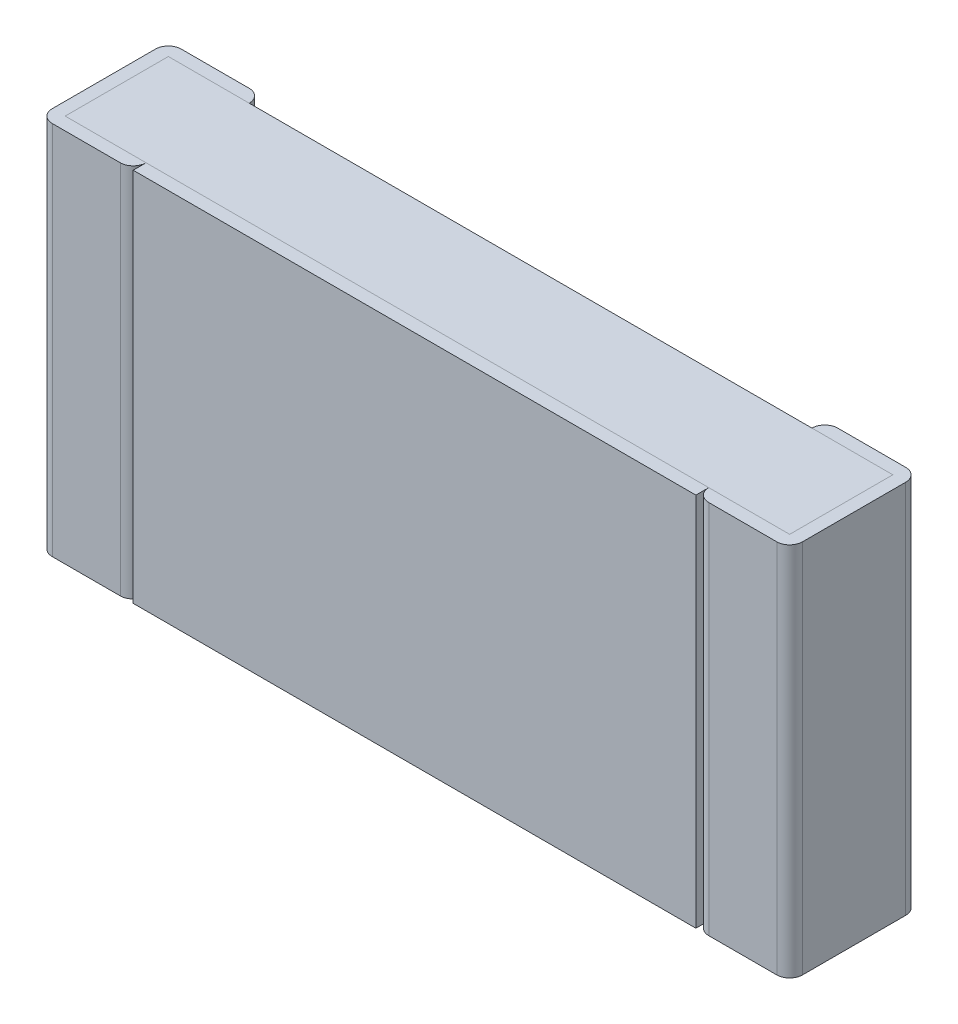
ISO-10303-21;
HEADER;
FILE_DESCRIPTION(('STEP AP214'),'2;1');
FILE_NAME('part.step','',(''),(''),'','','');
FILE_SCHEMA(('AUTOMOTIVE_DESIGN { 1 0 10303 214 1 1 1 1 }'));
ENDSEC;
DATA;
#1=APPLICATION_CONTEXT('core data for automotive mechanical design processes');
#2=APPLICATION_PROTOCOL_DEFINITION('international standard','automotive_design',2000,#1);
#3=PRODUCT_CONTEXT('',#1,'mechanical');
#4=PRODUCT('Part','Part','',(#3));
#5=PRODUCT_RELATED_PRODUCT_CATEGORY('part','',(#4));
#6=PRODUCT_DEFINITION_FORMATION('','',#4);
#7=PRODUCT_DEFINITION_CONTEXT('part definition',#1,'design');
#8=PRODUCT_DEFINITION('design','',#6,#7);
#9=PRODUCT_DEFINITION_SHAPE('','',#8);
#10=(LENGTH_UNIT() NAMED_UNIT(*) SI_UNIT(.MILLI.,.METRE.));
#11=(NAMED_UNIT(*) PLANE_ANGLE_UNIT() SI_UNIT($,.RADIAN.));
#12=(NAMED_UNIT(*) SI_UNIT($,.STERADIAN.) SOLID_ANGLE_UNIT());
#13=UNCERTAINTY_MEASURE_WITH_UNIT(LENGTH_MEASURE(1.E-05),#10,'distance_accuracy_value','');
#14=(GEOMETRIC_REPRESENTATION_CONTEXT(3) GLOBAL_UNCERTAINTY_ASSIGNED_CONTEXT((#13)) GLOBAL_UNIT_ASSIGNED_CONTEXT((#10,
#11,#12)) REPRESENTATION_CONTEXT('',''));
#15=CARTESIAN_POINT('',(0.,0.,0.));
#16=DIRECTION('',(0.,0.,1.));
#17=DIRECTION('',(1.,0.,0.));
#18=AXIS2_PLACEMENT_3D('',#15,#16,#17);
#19=CARTESIAN_POINT('',(-1.2,-0.8,0.55));
#20=DIRECTION('',(0.,0.,1.));
#21=DIRECTION('',(1.,0.,0.));
#22=AXIS2_PLACEMENT_3D('',#19,#20,#21);
#23=PLANE('',#22);
#24=DIRECTION('',(0.,1.,0.));
#25=VECTOR('',#24,1.);
#26=CARTESIAN_POINT('',(-1.2,-0.8,0.55));
#27=LINE('',#26,#25);
#28=CARTESIAN_POINT('',(-1.2,-0.8,0.55));
#29=VERTEX_POINT('',#28);
#30=CARTESIAN_POINT('',(-1.2,0.8,0.55));
#31=VERTEX_POINT('',#30);
#32=EDGE_CURVE('E305',#29,#31,#27,.T.);
#33=ORIENTED_EDGE('',*,*,#32,.F.);
#34=DIRECTION('',(1.,0.,0.));
#35=VECTOR('',#34,1.);
#36=CARTESIAN_POINT('',(-1.2,-0.8,0.55));
#37=LINE('',#36,#35);
#38=CARTESIAN_POINT('',(1.2,-0.8,0.55));
#39=VERTEX_POINT('',#38);
#40=EDGE_CURVE('E272',#29,#39,#37,.T.);
#41=ORIENTED_EDGE('',*,*,#40,.T.);
#42=DIRECTION('',(0.,1.,0.));
#43=VECTOR('',#42,1.);
#44=CARTESIAN_POINT('',(1.2,-0.8,0.55));
#45=LINE('',#44,#43);
#46=CARTESIAN_POINT('',(1.2,0.8,0.55));
#47=VERTEX_POINT('',#46);
#48=EDGE_CURVE('E11',#39,#47,#45,.T.);
#49=ORIENTED_EDGE('',*,*,#48,.T.);
#50=DIRECTION('',(1.,0.,0.));
#51=VECTOR('',#50,1.);
#52=CARTESIAN_POINT('',(-1.2,0.8,0.55));
#53=LINE('',#52,#51);
#54=EDGE_CURVE('E224',#31,#47,#53,.T.);
#55=ORIENTED_EDGE('',*,*,#54,.F.);
#56=EDGE_LOOP('',(#33,#41,#49,#55));
#57=FACE_BOUND('',#56,.T.);
#58=ADVANCED_FACE('F17',(#57),#23,.T.);
#59=CARTESIAN_POINT('',(1.2,-0.8,0.495));
#60=DIRECTION('',(1.,0.,0.));
#61=DIRECTION('',(0.,1.,0.));
#62=AXIS2_PLACEMENT_3D('',#59,#60,#61);
#63=PLANE('',#62);
#64=DIRECTION('',(0.,0.,1.));
#65=VECTOR('',#64,1.);
#66=CARTESIAN_POINT('',(1.2,-0.8,0.495));
#67=LINE('',#66,#65);
#68=CARTESIAN_POINT('',(1.2,-0.8,0.495));
#69=VERTEX_POINT('',#68);
#70=EDGE_CURVE('E276',#69,#39,#67,.T.);
#71=ORIENTED_EDGE('',*,*,#70,.F.);
#72=DIRECTION('',(0.,1.,0.));
#73=VECTOR('',#72,1.);
#74=CARTESIAN_POINT('',(1.2,-0.8,0.495));
#75=LINE('',#74,#73);
#76=CARTESIAN_POINT('',(1.2,0.8,0.495));
#77=VERTEX_POINT('',#76);
#78=EDGE_CURVE('E27',#69,#77,#75,.T.);
#79=ORIENTED_EDGE('',*,*,#78,.T.);
#80=DIRECTION('',(0.,0.,1.));
#81=VECTOR('',#80,1.);
#82=CARTESIAN_POINT('',(1.2,0.8,0.495));
#83=LINE('',#82,#81);
#84=EDGE_CURVE('E292',#77,#47,#83,.T.);
#85=ORIENTED_EDGE('',*,*,#84,.T.);
#86=ORIENTED_EDGE('',*,*,#48,.F.);
#87=EDGE_LOOP('',(#71,#79,#85,#86));
#88=FACE_BOUND('',#87,.T.);
#89=ADVANCED_FACE('F339',(#88),#63,.T.);
#90=CARTESIAN_POINT('',(1.255,-0.8,0.495));
#91=DIRECTION('',(0.,1.,0.));
#92=DIRECTION('',(-1.,0.,0.));
#93=AXIS2_PLACEMENT_3D('',#90,#91,#92);
#94=CYLINDRICAL_SURFACE('',#93,0.055);
#95=CARTESIAN_POINT('',(1.255,-0.8,0.495));
#96=DIRECTION('',(0.,1.,0.));
#97=DIRECTION('',(0.,0.,1.));
#98=AXIS2_PLACEMENT_3D('',#95,#96,#97);
#99=CIRCLE('',#98,0.055);
#100=CARTESIAN_POINT('',(1.255,-0.8,0.55));
#101=VERTEX_POINT('',#100);
#102=EDGE_CURVE('E309',#69,#101,#99,.T.);
#103=ORIENTED_EDGE('',*,*,#102,.T.);
#104=DIRECTION('',(0.,1.,0.));
#105=VECTOR('',#104,1.);
#106=CARTESIAN_POINT('',(1.255,-0.8,0.55));
#107=LINE('',#106,#105);
#108=CARTESIAN_POINT('',(1.255,0.8,0.55));
#109=VERTEX_POINT('',#108);
#110=EDGE_CURVE('E20',#101,#109,#107,.T.);
#111=ORIENTED_EDGE('',*,*,#110,.T.);
#112=CARTESIAN_POINT('',(1.255,0.8,0.495));
#113=DIRECTION('',(0.,1.,0.));
#114=DIRECTION('',(0.,0.,1.));
#115=AXIS2_PLACEMENT_3D('',#112,#113,#114);
#116=CIRCLE('',#115,0.055);
#117=EDGE_CURVE('E219',#77,#109,#116,.T.);
#118=ORIENTED_EDGE('',*,*,#117,.F.);
#119=ORIENTED_EDGE('',*,*,#78,.F.);
#120=EDGE_LOOP('',(#103,#111,#118,#119));
#121=FACE_BOUND('',#120,.T.);
#122=ADVANCED_FACE('F336',(#121),#94,.T.);
#123=CARTESIAN_POINT('',(1.2,-0.8,0.55));
#124=DIRECTION('',(0.,0.,1.));
#125=DIRECTION('',(1.,0.,0.));
#126=AXIS2_PLACEMENT_3D('',#123,#124,#125);
#127=PLANE('',#126);
#128=DIRECTION('',(1.,0.,0.));
#129=VECTOR('',#128,1.);
#130=CARTESIAN_POINT('',(1.2,0.8,0.55));
#131=LINE('',#130,#129);
#132=CARTESIAN_POINT('',(1.545,0.8,0.55));
#133=VERTEX_POINT('',#132);
#134=EDGE_CURVE('E213',#109,#133,#131,.T.);
#135=ORIENTED_EDGE('',*,*,#134,.F.);
#136=ORIENTED_EDGE('',*,*,#110,.F.);
#137=DIRECTION('',(1.,0.,0.));
#138=VECTOR('',#137,1.);
#139=CARTESIAN_POINT('',(1.2,-0.8,0.55));
#140=LINE('',#139,#138);
#141=CARTESIAN_POINT('',(1.545,-0.8,0.55));
#142=VERTEX_POINT('',#141);
#143=EDGE_CURVE('E313',#101,#142,#140,.T.);
#144=ORIENTED_EDGE('',*,*,#143,.T.);
#145=DIRECTION('',(0.,1.,0.));
#146=VECTOR('',#145,1.);
#147=CARTESIAN_POINT('',(1.545,-0.8,0.55));
#148=LINE('',#147,#146);
#149=EDGE_CURVE('E197',#142,#133,#148,.T.);
#150=ORIENTED_EDGE('',*,*,#149,.T.);
#151=EDGE_LOOP('',(#135,#136,#144,#150));
#152=FACE_BOUND('',#151,.T.);
#153=ADVANCED_FACE('F570',(#152),#127,.T.);
#154=CARTESIAN_POINT('',(1.545,-0.8,0.495));
#155=DIRECTION('',(0.,1.,0.));
#156=DIRECTION('',(1.,0.,0.));
#157=AXIS2_PLACEMENT_3D('',#154,#155,#156);
#158=CYLINDRICAL_SURFACE('',#157,0.055);
#159=DIRECTION('',(0.,1.,0.));
#160=VECTOR('',#159,1.);
#161=CARTESIAN_POINT('',(1.6,-0.8,0.495));
#162=LINE('',#161,#160);
#163=CARTESIAN_POINT('',(1.6,-0.8,0.495));
#164=VERTEX_POINT('',#163);
#165=CARTESIAN_POINT('',(1.6,0.8,0.495));
#166=VERTEX_POINT('',#165);
#167=EDGE_CURVE('E185',#164,#166,#162,.T.);
#168=ORIENTED_EDGE('',*,*,#167,.T.);
#169=CARTESIAN_POINT('',(1.545,0.8,0.495));
#170=DIRECTION('',(0.,-1.,0.));
#171=DIRECTION('',(0.,0.,1.));
#172=AXIS2_PLACEMENT_3D('',#169,#170,#171);
#173=CIRCLE('',#172,0.055);
#174=EDGE_CURVE('E189',#166,#133,#173,.T.);
#175=ORIENTED_EDGE('',*,*,#174,.T.);
#176=ORIENTED_EDGE('',*,*,#149,.F.);
#177=CARTESIAN_POINT('',(1.545,-0.8,0.495));
#178=DIRECTION('',(0.,-1.,0.));
#179=DIRECTION('',(0.,0.,1.));
#180=AXIS2_PLACEMENT_3D('',#177,#178,#179);
#181=CIRCLE('',#180,0.055);
#182=EDGE_CURVE('E192',#164,#142,#181,.T.);
#183=ORIENTED_EDGE('',*,*,#182,.F.);
#184=EDGE_LOOP('',(#168,#175,#176,#183));
#185=FACE_BOUND('',#184,.T.);
#186=ADVANCED_FACE('F187',(#185),#158,.T.);
#187=CARTESIAN_POINT('',(1.6,-0.8,0.));
#188=DIRECTION('',(1.,0.,0.));
#189=DIRECTION('',(0.,1.,0.));
#190=AXIS2_PLACEMENT_3D('',#187,#188,#189);
#191=PLANE('',#190);
#192=DIRECTION('',(0.,0.,1.));
#193=VECTOR('',#192,1.);
#194=CARTESIAN_POINT('',(1.6,-0.8,0.));
#195=LINE('',#194,#193);
#196=CARTESIAN_POINT('',(1.6,-0.8,0.055));
#197=VERTEX_POINT('',#196);
#198=EDGE_CURVE('E295',#197,#164,#195,.T.);
#199=ORIENTED_EDGE('',*,*,#198,.F.);
#200=DIRECTION('',(0.,1.,0.));
#201=VECTOR('',#200,1.);
#202=CARTESIAN_POINT('',(1.6,-0.8,0.055));
#203=LINE('',#202,#201);
#204=CARTESIAN_POINT('',(1.6,0.8,0.055));
#205=VERTEX_POINT('',#204);
#206=EDGE_CURVE('E198',#197,#205,#203,.T.);
#207=ORIENTED_EDGE('',*,*,#206,.T.);
#208=DIRECTION('',(0.,0.,1.));
#209=VECTOR('',#208,1.);
#210=CARTESIAN_POINT('',(1.6,0.8,0.));
#211=LINE('',#210,#209);
#212=EDGE_CURVE('E201',#205,#166,#211,.T.);
#213=ORIENTED_EDGE('',*,*,#212,.T.);
#214=ORIENTED_EDGE('',*,*,#167,.F.);
#215=EDGE_LOOP('',(#199,#207,#213,#214));
#216=FACE_BOUND('',#215,.T.);
#217=ADVANCED_FACE('F202',(#216),#191,.T.);
#218=CARTESIAN_POINT('',(1.545,-0.8,0.055));
#219=DIRECTION('',(0.,1.,0.));
#220=DIRECTION('',(1.,0.,0.));
#221=AXIS2_PLACEMENT_3D('',#218,#219,#220);
#222=CYLINDRICAL_SURFACE('',#221,0.055);
#223=CARTESIAN_POINT('',(1.545,-0.8,0.055));
#224=DIRECTION('',(0.,1.,0.));
#225=DIRECTION('',(0.,0.,1.));
#226=AXIS2_PLACEMENT_3D('',#223,#224,#225);
#227=CIRCLE('',#226,0.055);
#228=CARTESIAN_POINT('',(1.545,-0.8,0.));
#229=VERTEX_POINT('',#228);
#230=EDGE_CURVE('E298',#197,#229,#227,.T.);
#231=ORIENTED_EDGE('',*,*,#230,.T.);
#232=DIRECTION('',(0.,1.,0.));
#233=VECTOR('',#232,1.);
#234=CARTESIAN_POINT('',(1.545,-0.8,0.));
#235=LINE('',#234,#233);
#236=CARTESIAN_POINT('',(1.545,0.8,0.));
#237=VERTEX_POINT('',#236);
#238=EDGE_CURVE('E227',#229,#237,#235,.T.);
#239=ORIENTED_EDGE('',*,*,#238,.T.);
#240=CARTESIAN_POINT('',(1.545,0.8,0.055));
#241=DIRECTION('',(0.,1.,0.));
#242=DIRECTION('',(0.,0.,1.));
#243=AXIS2_PLACEMENT_3D('',#240,#241,#242);
#244=CIRCLE('',#243,0.055);
#245=EDGE_CURVE('E207',#205,#237,#244,.T.);
#246=ORIENTED_EDGE('',*,*,#245,.F.);
#247=ORIENTED_EDGE('',*,*,#206,.F.);
#248=EDGE_LOOP('',(#231,#239,#246,#247));
#249=FACE_BOUND('',#248,.T.);
#250=ADVANCED_FACE('F577',(#249),#222,.T.);
#251=CARTESIAN_POINT('',(1.2,-0.8,0.));
#252=DIRECTION('',(0.,0.,1.));
#253=DIRECTION('',(1.,0.,0.));
#254=AXIS2_PLACEMENT_3D('',#251,#252,#253);
#255=PLANE('',#254);
#256=ORIENTED_EDGE('',*,*,#238,.F.);
#257=DIRECTION('',(1.,0.,0.));
#258=VECTOR('',#257,1.);
#259=CARTESIAN_POINT('',(1.2,-0.8,0.));
#260=LINE('',#259,#258);
#261=CARTESIAN_POINT('',(1.255,-0.8,0.));
#262=VERTEX_POINT('',#261);
#263=EDGE_CURVE('E317',#262,#229,#260,.T.);
#264=ORIENTED_EDGE('',*,*,#263,.F.);
#265=DIRECTION('',(0.,1.,0.));
#266=VECTOR('',#265,1.);
#267=CARTESIAN_POINT('',(1.255,-0.8,0.));
#268=LINE('',#267,#266);
#269=CARTESIAN_POINT('',(1.255,0.8,0.));
#270=VERTEX_POINT('',#269);
#271=EDGE_CURVE('E229',#262,#270,#268,.T.);
#272=ORIENTED_EDGE('',*,*,#271,.T.);
#273=DIRECTION('',(1.,0.,0.));
#274=VECTOR('',#273,1.);
#275=CARTESIAN_POINT('',(1.2,0.8,0.));
#276=LINE('',#275,#274);
#277=EDGE_CURVE('E299',#270,#237,#276,.T.);
#278=ORIENTED_EDGE('',*,*,#277,.T.);
#279=EDGE_LOOP('',(#256,#264,#272,#278));
#280=FACE_BOUND('',#279,.T.);
#281=ADVANCED_FACE('F578',(#280),#255,.F.);
#282=CARTESIAN_POINT('',(1.255,-0.8,0.055));
#283=DIRECTION('',(0.,1.,0.));
#284=DIRECTION('',(-1.,0.,0.));
#285=AXIS2_PLACEMENT_3D('',#282,#283,#284);
#286=CYLINDRICAL_SURFACE('',#285,0.055);
#287=DIRECTION('',(0.,1.,0.));
#288=VECTOR('',#287,1.);
#289=CARTESIAN_POINT('',(1.2,-0.8,0.055));
#290=LINE('',#289,#288);
#291=CARTESIAN_POINT('',(1.2,-0.8,0.055));
#292=VERTEX_POINT('',#291);
#293=CARTESIAN_POINT('',(1.2,0.8,0.055));
#294=VERTEX_POINT('',#293);
#295=EDGE_CURVE('E291',#292,#294,#290,.T.);
#296=ORIENTED_EDGE('',*,*,#295,.T.);
#297=CARTESIAN_POINT('',(1.255,0.8,0.055));
#298=DIRECTION('',(0.,-1.,0.));
#299=DIRECTION('',(0.,0.,1.));
#300=AXIS2_PLACEMENT_3D('',#297,#298,#299);
#301=CIRCLE('',#300,0.055);
#302=EDGE_CURVE('E303',#294,#270,#301,.T.);
#303=ORIENTED_EDGE('',*,*,#302,.T.);
#304=ORIENTED_EDGE('',*,*,#271,.F.);
#305=CARTESIAN_POINT('',(1.255,-0.8,0.055));
#306=DIRECTION('',(0.,-1.,0.));
#307=DIRECTION('',(0.,0.,1.));
#308=AXIS2_PLACEMENT_3D('',#305,#306,#307);
#309=CIRCLE('',#308,0.055);
#310=EDGE_CURVE('E312',#292,#262,#309,.T.);
#311=ORIENTED_EDGE('',*,*,#310,.F.);
#312=EDGE_LOOP('',(#296,#303,#304,#311));
#313=FACE_BOUND('',#312,.T.);
#314=ADVANCED_FACE('F581',(#313),#286,.T.);
#315=CARTESIAN_POINT('',(-1.2,0.8,0.495));
#316=DIRECTION('',(0.,1.,0.));
#317=DIRECTION('',(1.,0.,0.));
#318=AXIS2_PLACEMENT_3D('',#315,#316,#317);
#319=PLANE('',#318);
#320=DIRECTION('',(1.,0.,0.));
#321=VECTOR('',#320,1.);
#322=CARTESIAN_POINT('',(-1.2,0.8,0.495));
#323=LINE('',#322,#321);
#324=CARTESIAN_POINT('',(-1.2,0.8,0.495));
#325=VERTEX_POINT('',#324);
#326=EDGE_CURVE('E267',#325,#77,#323,.T.);
#327=ORIENTED_EDGE('',*,*,#326,.F.);
#328=DIRECTION('',(0.,0.,1.));
#329=VECTOR('',#328,1.);
#330=CARTESIAN_POINT('',(-1.2,0.8,0.495));
#331=LINE('',#330,#329);
#332=EDGE_CURVE('E304',#325,#31,#331,.T.);
#333=ORIENTED_EDGE('',*,*,#332,.T.);
#334=ORIENTED_EDGE('',*,*,#54,.T.);
#335=ORIENTED_EDGE('',*,*,#84,.F.);
#336=EDGE_LOOP('',(#327,#333,#334,#335));
#337=FACE_BOUND('',#336,.T.);
#338=ADVANCED_FACE('F392',(#337),#319,.T.);
#339=CARTESIAN_POINT('',(1.2,0.8,0.));
#340=DIRECTION('',(0.,1.,0.));
#341=DIRECTION('',(1.,0.,0.));
#342=AXIS2_PLACEMENT_3D('',#339,#340,#341);
#343=PLANE('',#342);
#344=ORIENTED_EDGE('',*,*,#277,.F.);
#345=ORIENTED_EDGE('',*,*,#302,.F.);
#346=DIRECTION('',(1.,0.,0.));
#347=VECTOR('',#346,1.);
#348=CARTESIAN_POINT('',(-1.545,0.8,0.055));
#349=LINE('',#348,#347);
#350=CARTESIAN_POINT('',(1.545,0.8,0.055));
#351=VERTEX_POINT('',#350);
#352=EDGE_CURVE('E284',#294,#351,#349,.T.);
#353=ORIENTED_EDGE('',*,*,#352,.T.);
#354=DIRECTION('',(0.,0.,1.));
#355=VECTOR('',#354,1.);
#356=CARTESIAN_POINT('',(1.545,0.8,0.055));
#357=LINE('',#356,#355);
#358=CARTESIAN_POINT('',(1.545,0.8,0.495));
#359=VERTEX_POINT('',#358);
#360=EDGE_CURVE('E281',#351,#359,#357,.T.);
#361=ORIENTED_EDGE('',*,*,#360,.T.);
#362=DIRECTION('',(1.,0.,0.));
#363=VECTOR('',#362,1.);
#364=CARTESIAN_POINT('',(-1.545,0.8,0.495));
#365=LINE('',#364,#363);
#366=EDGE_CURVE('E280',#77,#359,#365,.T.);
#367=ORIENTED_EDGE('',*,*,#366,.F.);
#368=ORIENTED_EDGE('',*,*,#117,.T.);
#369=ORIENTED_EDGE('',*,*,#134,.T.);
#370=ORIENTED_EDGE('',*,*,#174,.F.);
#371=ORIENTED_EDGE('',*,*,#212,.F.);
#372=ORIENTED_EDGE('',*,*,#245,.T.);
#373=EDGE_LOOP('',(#344,#345,#353,#361,#367,#368,#369,#370,#371,#372));
#374=FACE_BOUND('',#373,.T.);
#375=ADVANCED_FACE('F210',(#374),#343,.T.);
#376=CARTESIAN_POINT('',(-1.2,-0.8,0.495));
#377=DIRECTION('',(1.,0.,0.));
#378=DIRECTION('',(0.,1.,0.));
#379=AXIS2_PLACEMENT_3D('',#376,#377,#378);
#380=PLANE('',#379);
#381=ORIENTED_EDGE('',*,*,#32,.T.);
#382=ORIENTED_EDGE('',*,*,#332,.F.);
#383=DIRECTION('',(0.,1.,0.));
#384=VECTOR('',#383,1.);
#385=CARTESIAN_POINT('',(-1.2,-0.8,0.495));
#386=LINE('',#385,#384);
#387=CARTESIAN_POINT('',(-1.2,-0.8,0.495));
#388=VERTEX_POINT('',#387);
#389=EDGE_CURVE('E263',#388,#325,#386,.T.);
#390=ORIENTED_EDGE('',*,*,#389,.F.);
#391=DIRECTION('',(0.,0.,1.));
#392=VECTOR('',#391,1.);
#393=CARTESIAN_POINT('',(-1.2,-0.8,0.495));
#394=LINE('',#393,#392);
#395=EDGE_CURVE('E275',#388,#29,#394,.T.);
#396=ORIENTED_EDGE('',*,*,#395,.T.);
#397=EDGE_LOOP('',(#381,#382,#390,#396));
#398=FACE_BOUND('',#397,.T.);
#399=ADVANCED_FACE('F394',(#398),#380,.F.);
#400=CARTESIAN_POINT('',(-1.2,-0.8,0.495));
#401=DIRECTION('',(0.,1.,0.));
#402=DIRECTION('',(1.,0.,0.));
#403=AXIS2_PLACEMENT_3D('',#400,#401,#402);
#404=PLANE('',#403);
#405=ORIENTED_EDGE('',*,*,#70,.T.);
#406=ORIENTED_EDGE('',*,*,#40,.F.);
#407=ORIENTED_EDGE('',*,*,#395,.F.);
#408=DIRECTION('',(1.,0.,0.));
#409=VECTOR('',#408,1.);
#410=CARTESIAN_POINT('',(-1.2,-0.8,0.495));
#411=LINE('',#410,#409);
#412=EDGE_CURVE('E262',#388,#69,#411,.T.);
#413=ORIENTED_EDGE('',*,*,#412,.T.);
#414=EDGE_LOOP('',(#405,#406,#407,#413));
#415=FACE_BOUND('',#414,.T.);
#416=ADVANCED_FACE('F349',(#415),#404,.F.);
#417=CARTESIAN_POINT('',(1.2,-0.8,0.));
#418=DIRECTION('',(0.,1.,0.));
#419=DIRECTION('',(1.,0.,0.));
#420=AXIS2_PLACEMENT_3D('',#417,#418,#419);
#421=PLANE('',#420);
#422=ORIENTED_EDGE('',*,*,#230,.F.);
#423=ORIENTED_EDGE('',*,*,#198,.T.);
#424=ORIENTED_EDGE('',*,*,#182,.T.);
#425=ORIENTED_EDGE('',*,*,#143,.F.);
#426=ORIENTED_EDGE('',*,*,#102,.F.);
#427=DIRECTION('',(1.,0.,0.));
#428=VECTOR('',#427,1.);
#429=CARTESIAN_POINT('',(-1.545,-0.8,0.495));
#430=LINE('',#429,#428);
#431=CARTESIAN_POINT('',(1.545,-0.8,0.495));
#432=VERTEX_POINT('',#431);
#433=EDGE_CURVE('E259',#69,#432,#430,.T.);
#434=ORIENTED_EDGE('',*,*,#433,.T.);
#435=DIRECTION('',(0.,0.,1.));
#436=VECTOR('',#435,1.);
#437=CARTESIAN_POINT('',(1.545,-0.8,0.055));
#438=LINE('',#437,#436);
#439=CARTESIAN_POINT('',(1.545,-0.8,0.055));
#440=VERTEX_POINT('',#439);
#441=EDGE_CURVE('E258',#440,#432,#438,.T.);
#442=ORIENTED_EDGE('',*,*,#441,.F.);
#443=DIRECTION('',(1.,0.,0.));
#444=VECTOR('',#443,1.);
#445=CARTESIAN_POINT('',(-1.545,-0.8,0.055));
#446=LINE('',#445,#444);
#447=EDGE_CURVE('E254',#292,#440,#446,.T.);
#448=ORIENTED_EDGE('',*,*,#447,.F.);
#449=ORIENTED_EDGE('',*,*,#310,.T.);
#450=ORIENTED_EDGE('',*,*,#263,.T.);
#451=EDGE_LOOP('',(#422,#423,#424,#425,#426,#434,#442,#448,#449,#450));
#452=FACE_BOUND('',#451,.T.);
#453=ADVANCED_FACE('F345',(#452),#421,.F.);
#454=CARTESIAN_POINT('',(-1.545,-0.8,0.055));
#455=DIRECTION('',(0.,0.,1.));
#456=DIRECTION('',(1.,0.,0.));
#457=AXIS2_PLACEMENT_3D('',#454,#455,#456);
#458=PLANE('',#457);
#459=DIRECTION('',(1.,0.,0.));
#460=VECTOR('',#459,1.);
#461=CARTESIAN_POINT('',(-1.545,0.8,0.055));
#462=LINE('',#461,#460);
#463=CARTESIAN_POINT('',(-1.2,0.8,0.055));
#464=VERTEX_POINT('',#463);
#465=EDGE_CURVE('E287',#464,#294,#462,.T.);
#466=ORIENTED_EDGE('',*,*,#465,.T.);
#467=ORIENTED_EDGE('',*,*,#295,.F.);
#468=DIRECTION('',(1.,0.,0.));
#469=VECTOR('',#468,1.);
#470=CARTESIAN_POINT('',(-1.545,-0.8,0.055));
#471=LINE('',#470,#469);
#472=CARTESIAN_POINT('',(-1.2,-0.8,0.055));
#473=VERTEX_POINT('',#472);
#474=EDGE_CURVE('E251',#473,#292,#471,.T.);
#475=ORIENTED_EDGE('',*,*,#474,.F.);
#476=DIRECTION('',(0.,1.,0.));
#477=VECTOR('',#476,1.);
#478=CARTESIAN_POINT('',(-1.2,-0.8,0.055));
#479=LINE('',#478,#477);
#480=EDGE_CURVE('E250',#473,#464,#479,.T.);
#481=ORIENTED_EDGE('',*,*,#480,.T.);
#482=EDGE_LOOP('',(#466,#467,#475,#481));
#483=FACE_BOUND('',#482,.T.);
#484=ADVANCED_FACE('F526',(#483),#458,.F.);
#485=CARTESIAN_POINT('',(-1.545,0.8,0.055));
#486=DIRECTION('',(0.,1.,0.));
#487=DIRECTION('',(1.,0.,0.));
#488=AXIS2_PLACEMENT_3D('',#485,#486,#487);
#489=PLANE('',#488);
#490=DIRECTION('',(1.,0.,0.));
#491=VECTOR('',#490,1.);
#492=CARTESIAN_POINT('',(-1.545,0.8,0.055));
#493=LINE('',#492,#491);
#494=CARTESIAN_POINT('',(-1.545,0.8,0.055));
#495=VERTEX_POINT('',#494);
#496=EDGE_CURVE('E364',#495,#464,#493,.T.);
#497=ORIENTED_EDGE('',*,*,#496,.F.);
#498=DIRECTION('',(0.,0.,1.));
#499=VECTOR('',#498,1.);
#500=CARTESIAN_POINT('',(-1.545,0.8,0.055));
#501=LINE('',#500,#499);
#502=CARTESIAN_POINT('',(-1.545,0.8,0.495));
#503=VERTEX_POINT('',#502);
#504=EDGE_CURVE('E367',#495,#503,#501,.T.);
#505=ORIENTED_EDGE('',*,*,#504,.T.);
#506=DIRECTION('',(1.,0.,0.));
#507=VECTOR('',#506,1.);
#508=CARTESIAN_POINT('',(-1.545,0.8,0.495));
#509=LINE('',#508,#507);
#510=EDGE_CURVE('E376',#503,#325,#509,.T.);
#511=ORIENTED_EDGE('',*,*,#510,.T.);
#512=ORIENTED_EDGE('',*,*,#326,.T.);
#513=ORIENTED_EDGE('',*,*,#366,.T.);
#514=ORIENTED_EDGE('',*,*,#360,.F.);
#515=ORIENTED_EDGE('',*,*,#352,.F.);
#516=ORIENTED_EDGE('',*,*,#465,.F.);
#517=EDGE_LOOP('',(#497,#505,#511,#512,#513,#514,#515,#516));
#518=FACE_BOUND('',#517,.T.);
#519=ADVANCED_FACE('F403',(#518),#489,.T.);
#520=CARTESIAN_POINT('',(-1.255,-0.8,0.495));
#521=DIRECTION('',(0.,1.,0.));
#522=DIRECTION('',(1.,0.,0.));
#523=AXIS2_PLACEMENT_3D('',#520,#521,#522);
#524=CYLINDRICAL_SURFACE('',#523,0.055);
#525=ORIENTED_EDGE('',*,*,#389,.T.);
#526=CARTESIAN_POINT('',(-1.255,0.8,0.495));
#527=DIRECTION('',(0.,-1.,0.));
#528=DIRECTION('',(0.,0.,1.));
#529=AXIS2_PLACEMENT_3D('',#526,#527,#528);
#530=CIRCLE('',#529,0.055);
#531=CARTESIAN_POINT('',(-1.255,0.8,0.55));
#532=VERTEX_POINT('',#531);
#533=EDGE_CURVE('E385',#325,#532,#530,.T.);
#534=ORIENTED_EDGE('',*,*,#533,.T.);
#535=DIRECTION('',(0.,1.,0.));
#536=VECTOR('',#535,1.);
#537=CARTESIAN_POINT('',(-1.255,-0.8,0.55));
#538=LINE('',#537,#536);
#539=CARTESIAN_POINT('',(-1.255,-0.8,0.55));
#540=VERTEX_POINT('',#539);
#541=EDGE_CURVE('E268',#540,#532,#538,.T.);
#542=ORIENTED_EDGE('',*,*,#541,.F.);
#543=CARTESIAN_POINT('',(-1.255,-0.8,0.495));
#544=DIRECTION('',(0.,-1.,0.));
#545=DIRECTION('',(0.,0.,1.));
#546=AXIS2_PLACEMENT_3D('',#543,#544,#545);
#547=CIRCLE('',#546,0.055);
#548=EDGE_CURVE('E401',#388,#540,#547,.T.);
#549=ORIENTED_EDGE('',*,*,#548,.F.);
#550=EDGE_LOOP('',(#525,#534,#542,#549));
#551=FACE_BOUND('',#550,.T.);
#552=ADVANCED_FACE('F397',(#551),#524,.T.);
#553=CARTESIAN_POINT('',(-1.6,-0.8,0.55));
#554=DIRECTION('',(0.,0.,1.));
#555=DIRECTION('',(1.,0.,0.));
#556=AXIS2_PLACEMENT_3D('',#553,#554,#555);
#557=PLANE('',#556);
#558=DIRECTION('',(1.,0.,0.));
#559=VECTOR('',#558,1.);
#560=CARTESIAN_POINT('',(-1.6,0.8,0.55));
#561=LINE('',#560,#559);
#562=CARTESIAN_POINT('',(-1.545,0.8,0.55));
#563=VERTEX_POINT('',#562);
#564=EDGE_CURVE('E406',#563,#532,#561,.T.);
#565=ORIENTED_EDGE('',*,*,#564,.F.);
#566=DIRECTION('',(0.,1.,0.));
#567=VECTOR('',#566,1.);
#568=CARTESIAN_POINT('',(-1.545,-0.8,0.55));
#569=LINE('',#568,#567);
#570=CARTESIAN_POINT('',(-1.545,-0.8,0.55));
#571=VERTEX_POINT('',#570);
#572=EDGE_CURVE('E419',#571,#563,#569,.T.);
#573=ORIENTED_EDGE('',*,*,#572,.F.);
#574=DIRECTION('',(1.,0.,0.));
#575=VECTOR('',#574,1.);
#576=CARTESIAN_POINT('',(-1.6,-0.8,0.55));
#577=LINE('',#576,#575);
#578=EDGE_CURVE('E431',#571,#540,#577,.T.);
#579=ORIENTED_EDGE('',*,*,#578,.T.);
#580=ORIENTED_EDGE('',*,*,#541,.T.);
#581=EDGE_LOOP('',(#565,#573,#579,#580));
#582=FACE_BOUND('',#581,.T.);
#583=ADVANCED_FACE('F553',(#582),#557,.T.);
#584=CARTESIAN_POINT('',(-1.545,-0.8,0.055));
#585=DIRECTION('',(0.,1.,0.));
#586=DIRECTION('',(1.,0.,0.));
#587=AXIS2_PLACEMENT_3D('',#584,#585,#586);
#588=PLANE('',#587);
#589=ORIENTED_EDGE('',*,*,#474,.T.);
#590=ORIENTED_EDGE('',*,*,#447,.T.);
#591=ORIENTED_EDGE('',*,*,#441,.T.);
#592=ORIENTED_EDGE('',*,*,#433,.F.);
#593=ORIENTED_EDGE('',*,*,#412,.F.);
#594=DIRECTION('',(1.,0.,0.));
#595=VECTOR('',#594,1.);
#596=CARTESIAN_POINT('',(-1.545,-0.8,0.495));
#597=LINE('',#596,#595);
#598=CARTESIAN_POINT('',(-1.545,-0.8,0.495));
#599=VERTEX_POINT('',#598);
#600=EDGE_CURVE('E445',#599,#388,#597,.T.);
#601=ORIENTED_EDGE('',*,*,#600,.F.);
#602=DIRECTION('',(0.,0.,1.));
#603=VECTOR('',#602,1.);
#604=CARTESIAN_POINT('',(-1.545,-0.8,0.055));
#605=LINE('',#604,#603);
#606=CARTESIAN_POINT('',(-1.545,-0.8,0.055));
#607=VERTEX_POINT('',#606);
#608=EDGE_CURVE('E448',#607,#599,#605,.T.);
#609=ORIENTED_EDGE('',*,*,#608,.F.);
#610=DIRECTION('',(1.,0.,0.));
#611=VECTOR('',#610,1.);
#612=CARTESIAN_POINT('',(-1.545,-0.8,0.055));
#613=LINE('',#612,#611);
#614=EDGE_CURVE('E456',#607,#473,#613,.T.);
#615=ORIENTED_EDGE('',*,*,#614,.T.);
#616=EDGE_LOOP('',(#589,#590,#591,#592,#593,#601,#609,#615));
#617=FACE_BOUND('',#616,.T.);
#618=ADVANCED_FACE('F356',(#617),#588,.F.);
#619=CARTESIAN_POINT('',(-1.255,-0.8,0.055));
#620=DIRECTION('',(0.,1.,0.));
#621=DIRECTION('',(1.,0.,0.));
#622=AXIS2_PLACEMENT_3D('',#619,#620,#621);
#623=CYLINDRICAL_SURFACE('',#622,0.055);
#624=CARTESIAN_POINT('',(-1.255,-0.8,0.055));
#625=DIRECTION('',(0.,1.,0.));
#626=DIRECTION('',(0.,0.,1.));
#627=AXIS2_PLACEMENT_3D('',#624,#625,#626);
#628=CIRCLE('',#627,0.055);
#629=CARTESIAN_POINT('',(-1.255,-0.8,0.));
#630=VERTEX_POINT('',#629);
#631=EDGE_CURVE('E460',#473,#630,#628,.T.);
#632=ORIENTED_EDGE('',*,*,#631,.T.);
#633=DIRECTION('',(0.,1.,0.));
#634=VECTOR('',#633,1.);
#635=CARTESIAN_POINT('',(-1.255,-0.8,0.));
#636=LINE('',#635,#634);
#637=CARTESIAN_POINT('',(-1.255,0.8,0.));
#638=VERTEX_POINT('',#637);
#639=EDGE_CURVE('E373',#630,#638,#636,.T.);
#640=ORIENTED_EDGE('',*,*,#639,.T.);
#641=CARTESIAN_POINT('',(-1.255,0.8,0.055));
#642=DIRECTION('',(0.,1.,0.));
#643=DIRECTION('',(0.,0.,1.));
#644=AXIS2_PLACEMENT_3D('',#641,#642,#643);
#645=CIRCLE('',#644,0.055);
#646=EDGE_CURVE('E366',#464,#638,#645,.T.);
#647=ORIENTED_EDGE('',*,*,#646,.F.);
#648=ORIENTED_EDGE('',*,*,#480,.F.);
#649=EDGE_LOOP('',(#632,#640,#647,#648));
#650=FACE_BOUND('',#649,.T.);
#651=ADVANCED_FACE('F530',(#650),#623,.T.);
#652=CARTESIAN_POINT('',(-1.6,-0.8,0.));
#653=DIRECTION('',(0.,0.,1.));
#654=DIRECTION('',(1.,0.,0.));
#655=AXIS2_PLACEMENT_3D('',#652,#653,#654);
#656=PLANE('',#655);
#657=ORIENTED_EDGE('',*,*,#639,.F.);
#658=DIRECTION('',(1.,0.,0.));
#659=VECTOR('',#658,1.);
#660=CARTESIAN_POINT('',(-1.6,-0.8,0.));
#661=LINE('',#660,#659);
#662=CARTESIAN_POINT('',(-1.545,-0.8,0.));
#663=VERTEX_POINT('',#662);
#664=EDGE_CURVE('E426',#663,#630,#661,.T.);
#665=ORIENTED_EDGE('',*,*,#664,.F.);
#666=DIRECTION('',(0.,1.,0.));
#667=VECTOR('',#666,1.);
#668=CARTESIAN_POINT('',(-1.545,-0.8,0.));
#669=LINE('',#668,#667);
#670=CARTESIAN_POINT('',(-1.545,0.8,0.));
#671=VERTEX_POINT('',#670);
#672=EDGE_CURVE('E421',#663,#671,#669,.T.);
#673=ORIENTED_EDGE('',*,*,#672,.T.);
#674=DIRECTION('',(1.,0.,0.));
#675=VECTOR('',#674,1.);
#676=CARTESIAN_POINT('',(-1.6,0.8,0.));
#677=LINE('',#676,#675);
#678=EDGE_CURVE('E411',#671,#638,#677,.T.);
#679=ORIENTED_EDGE('',*,*,#678,.T.);
#680=EDGE_LOOP('',(#657,#665,#673,#679));
#681=FACE_BOUND('',#680,.T.);
#682=ADVANCED_FACE('F537',(#681),#656,.F.);
#683=CARTESIAN_POINT('',(-1.6,0.8,0.));
#684=DIRECTION('',(0.,1.,0.));
#685=DIRECTION('',(1.,0.,0.));
#686=AXIS2_PLACEMENT_3D('',#683,#684,#685);
#687=PLANE('',#686);
#688=ORIENTED_EDGE('',*,*,#678,.F.);
#689=CARTESIAN_POINT('',(-1.545,0.8,0.055));
#690=DIRECTION('',(0.,-1.,0.));
#691=DIRECTION('',(0.,0.,1.));
#692=AXIS2_PLACEMENT_3D('',#689,#690,#691);
#693=CIRCLE('',#692,0.055);
#694=CARTESIAN_POINT('',(-1.6,0.8,0.055));
#695=VERTEX_POINT('',#694);
#696=EDGE_CURVE('E425',#695,#671,#693,.T.);
#697=ORIENTED_EDGE('',*,*,#696,.F.);
#698=DIRECTION('',(0.,0.,1.));
#699=VECTOR('',#698,1.);
#700=CARTESIAN_POINT('',(-1.6,0.8,0.));
#701=LINE('',#700,#699);
#702=CARTESIAN_POINT('',(-1.6,0.8,0.495));
#703=VERTEX_POINT('',#702);
#704=EDGE_CURVE('E477',#695,#703,#701,.T.);
#705=ORIENTED_EDGE('',*,*,#704,.T.);
#706=CARTESIAN_POINT('',(-1.545,0.8,0.495));
#707=DIRECTION('',(0.,1.,0.));
#708=DIRECTION('',(0.,0.,1.));
#709=AXIS2_PLACEMENT_3D('',#706,#707,#708);
#710=CIRCLE('',#709,0.055);
#711=EDGE_CURVE('E417',#703,#563,#710,.T.);
#712=ORIENTED_EDGE('',*,*,#711,.T.);
#713=ORIENTED_EDGE('',*,*,#564,.T.);
#714=ORIENTED_EDGE('',*,*,#533,.F.);
#715=ORIENTED_EDGE('',*,*,#510,.F.);
#716=ORIENTED_EDGE('',*,*,#504,.F.);
#717=ORIENTED_EDGE('',*,*,#496,.T.);
#718=ORIENTED_EDGE('',*,*,#646,.T.);
#719=EDGE_LOOP('',(#688,#697,#705,#712,#713,#714,#715,#716,#717,#718));
#720=FACE_BOUND('',#719,.T.);
#721=ADVANCED_FACE('F404',(#720),#687,.T.);
#722=CARTESIAN_POINT('',(-1.545,-0.8,0.495));
#723=DIRECTION('',(0.,1.,0.));
#724=DIRECTION('',(-1.,0.,0.));
#725=AXIS2_PLACEMENT_3D('',#722,#723,#724);
#726=CYLINDRICAL_SURFACE('',#725,0.055);
#727=CARTESIAN_POINT('',(-1.545,-0.8,0.495));
#728=DIRECTION('',(0.,1.,0.));
#729=DIRECTION('',(0.,0.,1.));
#730=AXIS2_PLACEMENT_3D('',#727,#728,#729);
#731=CIRCLE('',#730,0.055);
#732=CARTESIAN_POINT('',(-1.6,-0.8,0.495));
#733=VERTEX_POINT('',#732);
#734=EDGE_CURVE('E435',#733,#571,#731,.T.);
#735=ORIENTED_EDGE('',*,*,#734,.T.);
#736=ORIENTED_EDGE('',*,*,#572,.T.);
#737=ORIENTED_EDGE('',*,*,#711,.F.);
#738=DIRECTION('',(0.,1.,0.));
#739=VECTOR('',#738,1.);
#740=CARTESIAN_POINT('',(-1.6,-0.8,0.495));
#741=LINE('',#740,#739);
#742=EDGE_CURVE('E481',#733,#703,#741,.T.);
#743=ORIENTED_EDGE('',*,*,#742,.F.);
#744=EDGE_LOOP('',(#735,#736,#737,#743));
#745=FACE_BOUND('',#744,.T.);
#746=ADVANCED_FACE('F545',(#745),#726,.T.);
#747=CARTESIAN_POINT('',(-1.545,-0.8,0.055));
#748=DIRECTION('',(0.,1.,0.));
#749=DIRECTION('',(-1.,0.,0.));
#750=AXIS2_PLACEMENT_3D('',#747,#748,#749);
#751=CYLINDRICAL_SURFACE('',#750,0.055);
#752=DIRECTION('',(0.,1.,0.));
#753=VECTOR('',#752,1.);
#754=CARTESIAN_POINT('',(-1.6,-0.8,0.055));
#755=LINE('',#754,#753);
#756=CARTESIAN_POINT('',(-1.6,-0.8,0.055));
#757=VERTEX_POINT('',#756);
#758=EDGE_CURVE('E471',#757,#695,#755,.T.);
#759=ORIENTED_EDGE('',*,*,#758,.T.);
#760=ORIENTED_EDGE('',*,*,#696,.T.);
#761=ORIENTED_EDGE('',*,*,#672,.F.);
#762=CARTESIAN_POINT('',(-1.545,-0.8,0.055));
#763=DIRECTION('',(0.,-1.,0.));
#764=DIRECTION('',(0.,0.,1.));
#765=AXIS2_PLACEMENT_3D('',#762,#763,#764);
#766=CIRCLE('',#765,0.055);
#767=EDGE_CURVE('E430',#757,#663,#766,.T.);
#768=ORIENTED_EDGE('',*,*,#767,.F.);
#769=EDGE_LOOP('',(#759,#760,#761,#768));
#770=FACE_BOUND('',#769,.T.);
#771=ADVANCED_FACE('F497',(#770),#751,.T.);
#772=CARTESIAN_POINT('',(-1.6,-0.8,0.));
#773=DIRECTION('',(0.,1.,0.));
#774=DIRECTION('',(1.,0.,0.));
#775=AXIS2_PLACEMENT_3D('',#772,#773,#774);
#776=PLANE('',#775);
#777=ORIENTED_EDGE('',*,*,#631,.F.);
#778=ORIENTED_EDGE('',*,*,#614,.F.);
#779=ORIENTED_EDGE('',*,*,#608,.T.);
#780=ORIENTED_EDGE('',*,*,#600,.T.);
#781=ORIENTED_EDGE('',*,*,#548,.T.);
#782=ORIENTED_EDGE('',*,*,#578,.F.);
#783=ORIENTED_EDGE('',*,*,#734,.F.);
#784=DIRECTION('',(0.,0.,1.));
#785=VECTOR('',#784,1.);
#786=CARTESIAN_POINT('',(-1.6,-0.8,0.));
#787=LINE('',#786,#785);
#788=EDGE_CURVE('E464',#757,#733,#787,.T.);
#789=ORIENTED_EDGE('',*,*,#788,.F.);
#790=ORIENTED_EDGE('',*,*,#767,.T.);
#791=ORIENTED_EDGE('',*,*,#664,.T.);
#792=EDGE_LOOP('',(#777,#778,#779,#780,#781,#782,#783,#789,#790,#791));
#793=FACE_BOUND('',#792,.T.);
#794=ADVANCED_FACE('F521',(#793),#776,.F.);
#795=CARTESIAN_POINT('',(-1.6,-0.8,0.));
#796=DIRECTION('',(1.,0.,0.));
#797=DIRECTION('',(0.,1.,0.));
#798=AXIS2_PLACEMENT_3D('',#795,#796,#797);
#799=PLANE('',#798);
#800=ORIENTED_EDGE('',*,*,#742,.T.);
#801=ORIENTED_EDGE('',*,*,#704,.F.);
#802=ORIENTED_EDGE('',*,*,#758,.F.);
#803=ORIENTED_EDGE('',*,*,#788,.T.);
#804=EDGE_LOOP('',(#800,#801,#802,#803));
#805=FACE_BOUND('',#804,.T.);
#806=ADVANCED_FACE('F543',(#805),#799,.F.);
#807=CLOSED_SHELL('',(#58,#89,#122,#153,#186,#217,#250,#281,#314,#338,#375,#399,#416,#453,#484,
#519,#552,#583,#618,#651,#682,#721,#746,#771,#794,#806));
#808=MANIFOLD_SOLID_BREP('B1',#807);
#809=ADVANCED_BREP_SHAPE_REPRESENTATION('',(#18,#808),#14);
#810=SHAPE_DEFINITION_REPRESENTATION(#9,#809);
ENDSEC;
END-ISO-10303-21;
